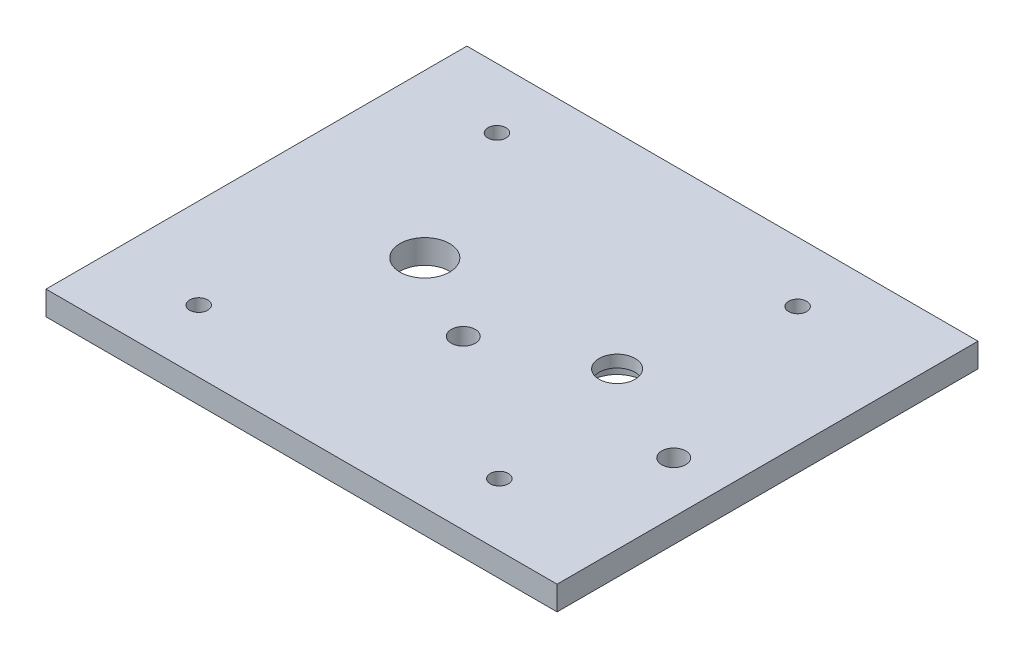
ISO-10303-21;
HEADER;
FILE_DESCRIPTION(('STEP AP214'),'2;1');
FILE_NAME('part.step','',(''),(''),'','','');
FILE_SCHEMA(('AUTOMOTIVE_DESIGN { 1 0 10303 214 1 1 1 1 }'));
ENDSEC;
DATA;
#1=APPLICATION_CONTEXT('core data for automotive mechanical design processes');
#2=APPLICATION_PROTOCOL_DEFINITION('international standard','automotive_design',2000,#1);
#3=PRODUCT_CONTEXT('',#1,'mechanical');
#4=PRODUCT('Part','Part','',(#3));
#5=PRODUCT_RELATED_PRODUCT_CATEGORY('part','',(#4));
#6=PRODUCT_DEFINITION_FORMATION('','',#4);
#7=PRODUCT_DEFINITION_CONTEXT('part definition',#1,'design');
#8=PRODUCT_DEFINITION('design','',#6,#7);
#9=PRODUCT_DEFINITION_SHAPE('','',#8);
#10=(LENGTH_UNIT() NAMED_UNIT(*) SI_UNIT(.MILLI.,.METRE.));
#11=(NAMED_UNIT(*) PLANE_ANGLE_UNIT() SI_UNIT($,.RADIAN.));
#12=(NAMED_UNIT(*) SI_UNIT($,.STERADIAN.) SOLID_ANGLE_UNIT());
#13=UNCERTAINTY_MEASURE_WITH_UNIT(LENGTH_MEASURE(1.E-05),#10,'distance_accuracy_value','');
#14=(GEOMETRIC_REPRESENTATION_CONTEXT(3) GLOBAL_UNCERTAINTY_ASSIGNED_CONTEXT((#13)) GLOBAL_UNIT_ASSIGNED_CONTEXT((#10,
#11,#12)) REPRESENTATION_CONTEXT('',''));
#15=CARTESIAN_POINT('',(0.,0.,0.));
#16=DIRECTION('',(0.,0.,1.));
#17=DIRECTION('',(1.,0.,0.));
#18=AXIS2_PLACEMENT_3D('',#15,#16,#17);
#19=CARTESIAN_POINT('',(42.5,4.,0.));
#20=DIRECTION('',(1.,0.,0.));
#21=DIRECTION('',(0.,0.,-1.));
#22=AXIS2_PLACEMENT_3D('',#19,#20,#21);
#23=PLANE('',#22);
#24=DIRECTION('',(0.,0.,1.));
#25=VECTOR('',#24,1.);
#26=CARTESIAN_POINT('',(42.5,0.,0.));
#27=LINE('',#26,#25);
#28=CARTESIAN_POINT('',(42.5,0.,-35.));
#29=VERTEX_POINT('',#28);
#30=CARTESIAN_POINT('',(42.5,0.,35.));
#31=VERTEX_POINT('',#30);
#32=EDGE_CURVE('E134',#29,#31,#27,.T.);
#33=ORIENTED_EDGE('',*,*,#32,.F.);
#34=DIRECTION('',(0.,-1.,0.));
#35=VECTOR('',#34,1.);
#36=CARTESIAN_POINT('',(42.5,4.,-35.));
#37=LINE('',#36,#35);
#38=CARTESIAN_POINT('',(42.5,4.,-35.));
#39=VERTEX_POINT('',#38);
#40=EDGE_CURVE('E11',#39,#29,#37,.T.);
#41=ORIENTED_EDGE('',*,*,#40,.F.);
#42=DIRECTION('',(0.,0.,1.));
#43=VECTOR('',#42,1.);
#44=CARTESIAN_POINT('',(42.5,4.,0.));
#45=LINE('',#44,#43);
#46=CARTESIAN_POINT('',(42.5,4.,35.));
#47=VERTEX_POINT('',#46);
#48=EDGE_CURVE('E103',#39,#47,#45,.T.);
#49=ORIENTED_EDGE('',*,*,#48,.T.);
#50=DIRECTION('',(0.,-1.,0.));
#51=VECTOR('',#50,1.);
#52=CARTESIAN_POINT('',(42.5,4.,35.));
#53=LINE('',#52,#51);
#54=EDGE_CURVE('E80',#47,#31,#53,.T.);
#55=ORIENTED_EDGE('',*,*,#54,.T.);
#56=EDGE_LOOP('',(#33,#41,#49,#55));
#57=FACE_BOUND('',#56,.T.);
#58=ADVANCED_FACE('F39',(#57),#23,.T.);
#59=CARTESIAN_POINT('',(0.,4.,-35.));
#60=DIRECTION('',(0.,0.,-1.));
#61=DIRECTION('',(-1.,0.,0.));
#62=AXIS2_PLACEMENT_3D('',#59,#60,#61);
#63=PLANE('',#62);
#64=DIRECTION('',(1.,0.,0.));
#65=VECTOR('',#64,1.);
#66=CARTESIAN_POINT('',(0.,0.,-35.));
#67=LINE('',#66,#65);
#68=CARTESIAN_POINT('',(-42.5,0.,-35.));
#69=VERTEX_POINT('',#68);
#70=EDGE_CURVE('E92',#69,#29,#67,.T.);
#71=ORIENTED_EDGE('',*,*,#70,.F.);
#72=DIRECTION('',(0.,-1.,0.));
#73=VECTOR('',#72,1.);
#74=CARTESIAN_POINT('',(-42.5,4.,-35.));
#75=LINE('',#74,#73);
#76=CARTESIAN_POINT('',(-42.5,4.,-35.));
#77=VERTEX_POINT('',#76);
#78=EDGE_CURVE('E49',#77,#69,#75,.T.);
#79=ORIENTED_EDGE('',*,*,#78,.F.);
#80=DIRECTION('',(1.,0.,0.));
#81=VECTOR('',#80,1.);
#82=CARTESIAN_POINT('',(0.,4.,-35.));
#83=LINE('',#82,#81);
#84=EDGE_CURVE('E90',#77,#39,#83,.T.);
#85=ORIENTED_EDGE('',*,*,#84,.T.);
#86=ORIENTED_EDGE('',*,*,#40,.T.);
#87=EDGE_LOOP('',(#71,#79,#85,#86));
#88=FACE_BOUND('',#87,.T.);
#89=ADVANCED_FACE('F88',(#88),#63,.T.);
#90=CARTESIAN_POINT('',(-42.5,4.,0.));
#91=DIRECTION('',(1.,0.,0.));
#92=DIRECTION('',(0.,0.,-1.));
#93=AXIS2_PLACEMENT_3D('',#90,#91,#92);
#94=PLANE('',#93);
#95=DIRECTION('',(0.,0.,1.));
#96=VECTOR('',#95,1.);
#97=CARTESIAN_POINT('',(-42.5,0.,0.));
#98=LINE('',#97,#96);
#99=CARTESIAN_POINT('',(-42.5,0.,35.));
#100=VERTEX_POINT('',#99);
#101=EDGE_CURVE('E137',#69,#100,#98,.T.);
#102=ORIENTED_EDGE('',*,*,#101,.T.);
#103=DIRECTION('',(0.,-1.,0.));
#104=VECTOR('',#103,1.);
#105=CARTESIAN_POINT('',(-42.5,4.,35.));
#106=LINE('',#105,#104);
#107=CARTESIAN_POINT('',(-42.5,4.,35.));
#108=VERTEX_POINT('',#107);
#109=EDGE_CURVE('E95',#108,#100,#106,.T.);
#110=ORIENTED_EDGE('',*,*,#109,.F.);
#111=DIRECTION('',(0.,0.,1.));
#112=VECTOR('',#111,1.);
#113=CARTESIAN_POINT('',(-42.5,4.,0.));
#114=LINE('',#113,#112);
#115=EDGE_CURVE('E98',#77,#108,#114,.T.);
#116=ORIENTED_EDGE('',*,*,#115,.F.);
#117=ORIENTED_EDGE('',*,*,#78,.T.);
#118=EDGE_LOOP('',(#102,#110,#116,#117));
#119=FACE_BOUND('',#118,.T.);
#120=ADVANCED_FACE('F99',(#119),#94,.F.);
#121=CARTESIAN_POINT('',(-0.999999999999987,4.,7.10266073478272));
#122=DIRECTION('',(0.,-1.,0.));
#123=DIRECTION('',(0.,0.,-1.));
#124=AXIS2_PLACEMENT_3D('',#121,#122,#123);
#125=CYLINDRICAL_SURFACE('',#124,2.);
#126=CARTESIAN_POINT('',(-0.999999999999987,4.,7.10266073478272));
#127=DIRECTION('',(0.,1.,0.));
#128=DIRECTION('',(0.,0.,1.));
#129=AXIS2_PLACEMENT_3D('',#126,#127,#128);
#130=CIRCLE('',#129,2.);
#131=CARTESIAN_POINT('',(-0.999999999999987,4.,9.10266073478272));
#132=VERTEX_POINT('',#131);
#133=EDGE_CURVE('E116',#132,#132,#130,.T.);
#134=ORIENTED_EDGE('',*,*,#133,.T.);
#135=EDGE_LOOP('',(#134));
#136=FACE_BOUND('',#135,.T.);
#137=CARTESIAN_POINT('',(-0.999999999999987,0.,7.10266073478272));
#138=DIRECTION('',(0.,1.,0.));
#139=DIRECTION('',(0.,0.,1.));
#140=AXIS2_PLACEMENT_3D('',#137,#138,#139);
#141=CIRCLE('',#140,2.);
#142=CARTESIAN_POINT('',(-0.999999999999987,0.,9.10266073478272));
#143=VERTEX_POINT('',#142);
#144=EDGE_CURVE('E146',#143,#143,#141,.T.);
#145=ORIENTED_EDGE('',*,*,#144,.F.);
#146=EDGE_LOOP('',(#145));
#147=FACE_BOUND('',#146,.T.);
#148=ADVANCED_FACE('F209',(#136,#147),#125,.F.);
#149=CARTESIAN_POINT('',(-15.5,4.,-0.999999999999982));
#150=DIRECTION('',(0.,-1.,0.));
#151=DIRECTION('',(0.,0.,-1.));
#152=AXIS2_PLACEMENT_3D('',#149,#150,#151);
#153=CYLINDRICAL_SURFACE('',#152,4.125);
#154=CARTESIAN_POINT('',(-15.5,4.,-0.999999999999982));
#155=DIRECTION('',(0.,1.,0.));
#156=DIRECTION('',(0.,0.,1.));
#157=AXIS2_PLACEMENT_3D('',#154,#155,#156);
#158=CIRCLE('',#157,4.125);
#159=CARTESIAN_POINT('',(-15.5,4.,3.12500000000002));
#160=VERTEX_POINT('',#159);
#161=EDGE_CURVE('E113',#160,#160,#158,.T.);
#162=ORIENTED_EDGE('',*,*,#161,.T.);
#163=EDGE_LOOP('',(#162));
#164=FACE_BOUND('',#163,.T.);
#165=CARTESIAN_POINT('',(-15.5,0.,-0.999999999999982));
#166=DIRECTION('',(0.,1.,0.));
#167=DIRECTION('',(0.,0.,1.));
#168=AXIS2_PLACEMENT_3D('',#165,#166,#167);
#169=CIRCLE('',#168,4.125);
#170=CARTESIAN_POINT('',(-15.5,0.,3.12500000000002));
#171=VERTEX_POINT('',#170);
#172=EDGE_CURVE('E143',#171,#171,#169,.T.);
#173=ORIENTED_EDGE('',*,*,#172,.F.);
#174=EDGE_LOOP('',(#173));
#175=FACE_BOUND('',#174,.T.);
#176=ADVANCED_FACE('F212',(#164,#175),#153,.F.);
#177=CARTESIAN_POINT('',(-27.5,4.,24.6066772895717));
#178=DIRECTION('',(0.,-1.,0.));
#179=DIRECTION('',(0.,0.,-1.));
#180=AXIS2_PLACEMENT_3D('',#177,#178,#179);
#181=CYLINDRICAL_SURFACE('',#180,1.5);
#182=CARTESIAN_POINT('',(-27.5,4.,24.6066772895717));
#183=DIRECTION('',(0.,1.,0.));
#184=DIRECTION('',(0.,0.,1.));
#185=AXIS2_PLACEMENT_3D('',#182,#183,#184);
#186=CIRCLE('',#185,1.5);
#187=CARTESIAN_POINT('',(-27.5,4.,26.1066772895717));
#188=VERTEX_POINT('',#187);
#189=EDGE_CURVE('E110',#188,#188,#186,.F.);
#190=ORIENTED_EDGE('',*,*,#189,.F.);
#191=EDGE_LOOP('',(#190));
#192=FACE_BOUND('',#191,.T.);
#193=CARTESIAN_POINT('',(-27.5,0.,24.6066772895717));
#194=DIRECTION('',(0.,1.,0.));
#195=DIRECTION('',(0.,0.,1.));
#196=AXIS2_PLACEMENT_3D('',#193,#194,#195);
#197=CIRCLE('',#196,1.5);
#198=CARTESIAN_POINT('',(-27.5,0.,26.1066772895717));
#199=VERTEX_POINT('',#198);
#200=EDGE_CURVE('E140',#199,#199,#197,.F.);
#201=ORIENTED_EDGE('',*,*,#200,.T.);
#202=EDGE_LOOP('',(#201));
#203=FACE_BOUND('',#202,.T.);
#204=ADVANCED_FACE('F216',(#192,#203),#181,.F.);
#205=CARTESIAN_POINT('',(0.,4.,35.));
#206=DIRECTION('',(0.,0.,-1.));
#207=DIRECTION('',(-1.,0.,0.));
#208=AXIS2_PLACEMENT_3D('',#205,#206,#207);
#209=PLANE('',#208);
#210=DIRECTION('',(1.,0.,0.));
#211=VECTOR('',#210,1.);
#212=CARTESIAN_POINT('',(0.,0.,35.));
#213=LINE('',#212,#211);
#214=EDGE_CURVE('E73',#100,#31,#213,.T.);
#215=ORIENTED_EDGE('',*,*,#214,.T.);
#216=ORIENTED_EDGE('',*,*,#54,.F.);
#217=DIRECTION('',(1.,0.,0.));
#218=VECTOR('',#217,1.);
#219=CARTESIAN_POINT('',(0.,4.,35.));
#220=LINE('',#219,#218);
#221=EDGE_CURVE('E57',#108,#47,#220,.T.);
#222=ORIENTED_EDGE('',*,*,#221,.F.);
#223=ORIENTED_EDGE('',*,*,#109,.T.);
#224=EDGE_LOOP('',(#215,#216,#222,#223));
#225=FACE_BOUND('',#224,.T.);
#226=ADVANCED_FACE('F152',(#225),#209,.F.);
#227=CARTESIAN_POINT('',(-27.5,4.,-25.));
#228=DIRECTION('',(0.,-1.,0.));
#229=DIRECTION('',(0.,0.,-1.));
#230=AXIS2_PLACEMENT_3D('',#227,#228,#229);
#231=CYLINDRICAL_SURFACE('',#230,1.5);
#232=CARTESIAN_POINT('',(-27.5,4.,-25.));
#233=DIRECTION('',(0.,1.,0.));
#234=DIRECTION('',(0.,0.,1.));
#235=AXIS2_PLACEMENT_3D('',#232,#233,#234);
#236=CIRCLE('',#235,1.5);
#237=CARTESIAN_POINT('',(-27.5,4.,-23.5));
#238=VERTEX_POINT('',#237);
#239=EDGE_CURVE('E105',#238,#238,#236,.T.);
#240=ORIENTED_EDGE('',*,*,#239,.T.);
#241=EDGE_LOOP('',(#240));
#242=FACE_BOUND('',#241,.T.);
#243=CARTESIAN_POINT('',(-27.5,0.,-25.));
#244=DIRECTION('',(0.,1.,0.));
#245=DIRECTION('',(0.,0.,1.));
#246=AXIS2_PLACEMENT_3D('',#243,#244,#245);
#247=CIRCLE('',#246,1.5);
#248=CARTESIAN_POINT('',(-27.5,0.,-23.5));
#249=VERTEX_POINT('',#248);
#250=EDGE_CURVE('E131',#249,#249,#247,.T.);
#251=ORIENTED_EDGE('',*,*,#250,.F.);
#252=EDGE_LOOP('',(#251));
#253=FACE_BOUND('',#252,.T.);
#254=ADVANCED_FACE('F163',(#242,#253),#231,.F.);
#255=CARTESIAN_POINT('',(22.5,4.,-25.));
#256=DIRECTION('',(0.,-1.,0.));
#257=DIRECTION('',(0.,0.,-1.));
#258=AXIS2_PLACEMENT_3D('',#255,#256,#257);
#259=CYLINDRICAL_SURFACE('',#258,1.5);
#260=CARTESIAN_POINT('',(22.5,4.,-25.));
#261=DIRECTION('',(0.,1.,0.));
#262=DIRECTION('',(0.,0.,1.));
#263=AXIS2_PLACEMENT_3D('',#260,#261,#262);
#264=CIRCLE('',#263,1.5);
#265=CARTESIAN_POINT('',(22.5,4.,-23.5));
#266=VERTEX_POINT('',#265);
#267=EDGE_CURVE('E313',#266,#266,#264,.T.);
#268=ORIENTED_EDGE('',*,*,#267,.T.);
#269=EDGE_LOOP('',(#268));
#270=FACE_BOUND('',#269,.T.);
#271=CARTESIAN_POINT('',(22.5,0.,-25.));
#272=DIRECTION('',(0.,1.,0.));
#273=DIRECTION('',(0.,0.,1.));
#274=AXIS2_PLACEMENT_3D('',#271,#272,#273);
#275=CIRCLE('',#274,1.5);
#276=CARTESIAN_POINT('',(22.5,0.,-23.5));
#277=VERTEX_POINT('',#276);
#278=EDGE_CURVE('E128',#277,#277,#275,.T.);
#279=ORIENTED_EDGE('',*,*,#278,.F.);
#280=EDGE_LOOP('',(#279));
#281=FACE_BOUND('',#280,.T.);
#282=ADVANCED_FACE('F166',(#270,#281),#259,.F.);
#283=CARTESIAN_POINT('',(22.5,4.,24.6066772895717));
#284=DIRECTION('',(0.,-1.,0.));
#285=DIRECTION('',(0.,0.,-1.));
#286=AXIS2_PLACEMENT_3D('',#283,#284,#285);
#287=CYLINDRICAL_SURFACE('',#286,1.5);
#288=CARTESIAN_POINT('',(22.5,4.,24.6066772895717));
#289=DIRECTION('',(0.,1.,0.));
#290=DIRECTION('',(0.,0.,1.));
#291=AXIS2_PLACEMENT_3D('',#288,#289,#290);
#292=CIRCLE('',#291,1.5);
#293=CARTESIAN_POINT('',(22.5,4.,26.1066772895717));
#294=VERTEX_POINT('',#293);
#295=EDGE_CURVE('E181',#294,#294,#292,.F.);
#296=ORIENTED_EDGE('',*,*,#295,.F.);
#297=EDGE_LOOP('',(#296));
#298=FACE_BOUND('',#297,.T.);
#299=CARTESIAN_POINT('',(22.5,0.,24.6066772895717));
#300=DIRECTION('',(0.,1.,0.));
#301=DIRECTION('',(0.,0.,1.));
#302=AXIS2_PLACEMENT_3D('',#299,#300,#301);
#303=CIRCLE('',#302,1.5);
#304=CARTESIAN_POINT('',(22.5,0.,26.1066772895717));
#305=VERTEX_POINT('',#304);
#306=EDGE_CURVE('E125',#305,#305,#303,.F.);
#307=ORIENTED_EDGE('',*,*,#306,.T.);
#308=EDGE_LOOP('',(#307));
#309=FACE_BOUND('',#308,.T.);
#310=ADVANCED_FACE('F169',(#298,#309),#287,.F.);
#311=CARTESIAN_POINT('',(34.,4.,7.10266073478268));
#312=DIRECTION('',(0.,-1.,0.));
#313=DIRECTION('',(0.,0.,-1.));
#314=AXIS2_PLACEMENT_3D('',#311,#312,#313);
#315=CYLINDRICAL_SURFACE('',#314,2.);
#316=CARTESIAN_POINT('',(34.,4.,7.10266073478268));
#317=DIRECTION('',(0.,1.,0.));
#318=DIRECTION('',(0.,0.,1.));
#319=AXIS2_PLACEMENT_3D('',#316,#317,#318);
#320=CIRCLE('',#319,2.);
#321=CARTESIAN_POINT('',(34.,4.,9.10266073478269));
#322=VERTEX_POINT('',#321);
#323=EDGE_CURVE('E149',#322,#322,#320,.T.);
#324=ORIENTED_EDGE('',*,*,#323,.T.);
#325=EDGE_LOOP('',(#324));
#326=FACE_BOUND('',#325,.T.);
#327=CARTESIAN_POINT('',(34.,0.,7.10266073478268));
#328=DIRECTION('',(0.,1.,0.));
#329=DIRECTION('',(0.,0.,1.));
#330=AXIS2_PLACEMENT_3D('',#327,#328,#329);
#331=CIRCLE('',#330,2.);
#332=CARTESIAN_POINT('',(34.,0.,9.10266073478269));
#333=VERTEX_POINT('',#332);
#334=EDGE_CURVE('E122',#333,#333,#331,.T.);
#335=ORIENTED_EDGE('',*,*,#334,.F.);
#336=EDGE_LOOP('',(#335));
#337=FACE_BOUND('',#336,.T.);
#338=ADVANCED_FACE('F41',(#326,#337),#315,.F.);
#339=CARTESIAN_POINT('',(16.4783394877401,4.,-0.999882702112446));
#340=DIRECTION('',(0.,-1.,0.));
#341=DIRECTION('',(0.,0.,-1.));
#342=AXIS2_PLACEMENT_3D('',#339,#340,#341);
#343=CYLINDRICAL_SURFACE('',#342,2.99999999999999);
#344=CARTESIAN_POINT('',(16.4783394877401,2.,-0.999882702112446));
#345=DIRECTION('',(0.,1.,0.));
#346=DIRECTION('',(0.,0.,1.));
#347=AXIS2_PLACEMENT_3D('',#344,#345,#346);
#348=CIRCLE('',#347,2.99999999999999);
#349=CARTESIAN_POINT('',(16.4783394877401,2.,2.00011729788755));
#350=VERTEX_POINT('',#349);
#351=EDGE_CURVE('E43',#350,#350,#348,.T.);
#352=ORIENTED_EDGE('',*,*,#351,.F.);
#353=EDGE_LOOP('',(#352));
#354=FACE_BOUND('',#353,.T.);
#355=CARTESIAN_POINT('',(16.4783394877401,4.,-0.999882702112446));
#356=DIRECTION('',(0.,1.,0.));
#357=DIRECTION('',(0.,0.,1.));
#358=AXIS2_PLACEMENT_3D('',#355,#356,#357);
#359=CIRCLE('',#358,2.99999999999999);
#360=CARTESIAN_POINT('',(16.4783394877401,4.,2.00011729788755));
#361=VERTEX_POINT('',#360);
#362=EDGE_CURVE('E119',#361,#361,#359,.T.);
#363=ORIENTED_EDGE('',*,*,#362,.T.);
#364=EDGE_LOOP('',(#363));
#365=FACE_BOUND('',#364,.T.);
#366=ADVANCED_FACE('F176',(#354,#365),#343,.F.);
#367=CARTESIAN_POINT('',(0.,4.,0.));
#368=DIRECTION('',(0.,1.,0.));
#369=DIRECTION('',(0.,0.,1.));
#370=AXIS2_PLACEMENT_3D('',#367,#368,#369);
#371=PLANE('',#370);
#372=ORIENTED_EDGE('',*,*,#323,.F.);
#373=EDGE_LOOP('',(#372));
#374=FACE_BOUND('',#373,.T.);
#375=ORIENTED_EDGE('',*,*,#295,.T.);
#376=EDGE_LOOP('',(#375));
#377=FACE_BOUND('',#376,.T.);
#378=ORIENTED_EDGE('',*,*,#267,.F.);
#379=EDGE_LOOP('',(#378));
#380=FACE_BOUND('',#379,.T.);
#381=ORIENTED_EDGE('',*,*,#239,.F.);
#382=EDGE_LOOP('',(#381));
#383=FACE_BOUND('',#382,.T.);
#384=ORIENTED_EDGE('',*,*,#48,.F.);
#385=ORIENTED_EDGE('',*,*,#84,.F.);
#386=ORIENTED_EDGE('',*,*,#115,.T.);
#387=ORIENTED_EDGE('',*,*,#221,.T.);
#388=EDGE_LOOP('',(#384,#385,#386,#387));
#389=FACE_BOUND('',#388,.T.);
#390=ORIENTED_EDGE('',*,*,#189,.T.);
#391=EDGE_LOOP('',(#390));
#392=FACE_BOUND('',#391,.T.);
#393=ORIENTED_EDGE('',*,*,#161,.F.);
#394=EDGE_LOOP('',(#393));
#395=FACE_BOUND('',#394,.T.);
#396=ORIENTED_EDGE('',*,*,#133,.F.);
#397=EDGE_LOOP('',(#396));
#398=FACE_BOUND('',#397,.T.);
#399=ORIENTED_EDGE('',*,*,#362,.F.);
#400=EDGE_LOOP('',(#399));
#401=FACE_BOUND('',#400,.T.);
#402=ADVANCED_FACE('F101',(#374,#377,#380,#383,#389,#392,#395,#398,#401),#371,.T.);
#403=CARTESIAN_POINT('',(0.,0.,0.));
#404=DIRECTION('',(0.,1.,0.));
#405=DIRECTION('',(0.,0.,1.));
#406=AXIS2_PLACEMENT_3D('',#403,#404,#405);
#407=PLANE('',#406);
#408=CARTESIAN_POINT('',(16.4783394877401,0.,-0.999882702112446));
#409=DIRECTION('',(0.,1.,0.));
#410=DIRECTION('',(0.,0.,1.));
#411=AXIS2_PLACEMENT_3D('',#408,#409,#410);
#412=CIRCLE('',#411,4.5);
#413=CARTESIAN_POINT('',(16.4783394877401,0.,3.50011729788756));
#414=VERTEX_POINT('',#413);
#415=EDGE_CURVE('E306',#414,#414,#412,.T.);
#416=ORIENTED_EDGE('',*,*,#415,.T.);
#417=EDGE_LOOP('',(#416));
#418=FACE_BOUND('',#417,.T.);
#419=ORIENTED_EDGE('',*,*,#334,.T.);
#420=EDGE_LOOP('',(#419));
#421=FACE_BOUND('',#420,.T.);
#422=ORIENTED_EDGE('',*,*,#306,.F.);
#423=EDGE_LOOP('',(#422));
#424=FACE_BOUND('',#423,.T.);
#425=ORIENTED_EDGE('',*,*,#278,.T.);
#426=EDGE_LOOP('',(#425));
#427=FACE_BOUND('',#426,.T.);
#428=ORIENTED_EDGE('',*,*,#250,.T.);
#429=EDGE_LOOP('',(#428));
#430=FACE_BOUND('',#429,.T.);
#431=ORIENTED_EDGE('',*,*,#32,.T.);
#432=ORIENTED_EDGE('',*,*,#214,.F.);
#433=ORIENTED_EDGE('',*,*,#101,.F.);
#434=ORIENTED_EDGE('',*,*,#70,.T.);
#435=EDGE_LOOP('',(#431,#432,#433,#434));
#436=FACE_BOUND('',#435,.T.);
#437=ORIENTED_EDGE('',*,*,#200,.F.);
#438=EDGE_LOOP('',(#437));
#439=FACE_BOUND('',#438,.T.);
#440=ORIENTED_EDGE('',*,*,#172,.T.);
#441=EDGE_LOOP('',(#440));
#442=FACE_BOUND('',#441,.T.);
#443=ORIENTED_EDGE('',*,*,#144,.T.);
#444=EDGE_LOOP('',(#443));
#445=FACE_BOUND('',#444,.T.);
#446=ADVANCED_FACE('F153',(#418,#421,#424,#427,#430,#436,#439,#442,#445),#407,.F.);
#447=CARTESIAN_POINT('',(16.4783394877401,2.,-0.999882702112446));
#448=DIRECTION('',(0.,-1.,0.));
#449=DIRECTION('',(0.,0.,-1.));
#450=AXIS2_PLACEMENT_3D('',#447,#448,#449);
#451=CYLINDRICAL_SURFACE('',#450,4.5);
#452=CARTESIAN_POINT('',(16.4783394877401,2.,-0.999882702112446));
#453=DIRECTION('',(0.,1.,0.));
#454=DIRECTION('',(0.,0.,1.));
#455=AXIS2_PLACEMENT_3D('',#452,#453,#454);
#456=CIRCLE('',#455,4.5);
#457=CARTESIAN_POINT('',(16.4783394877401,2.,3.50011729788756));
#458=VERTEX_POINT('',#457);
#459=EDGE_CURVE('E305',#458,#458,#456,.T.);
#460=ORIENTED_EDGE('',*,*,#459,.T.);
#461=EDGE_LOOP('',(#460));
#462=FACE_BOUND('',#461,.T.);
#463=ORIENTED_EDGE('',*,*,#415,.F.);
#464=EDGE_LOOP('',(#463));
#465=FACE_BOUND('',#464,.T.);
#466=ADVANCED_FACE('F186',(#462,#465),#451,.F.);
#467=CARTESIAN_POINT('',(16.4783394877401,2.,-0.999882702112446));
#468=DIRECTION('',(0.,1.,0.));
#469=DIRECTION('',(0.,0.,1.));
#470=AXIS2_PLACEMENT_3D('',#467,#468,#469);
#471=PLANE('',#470);
#472=ORIENTED_EDGE('',*,*,#351,.T.);
#473=EDGE_LOOP('',(#472));
#474=FACE_BOUND('',#473,.T.);
#475=ORIENTED_EDGE('',*,*,#459,.F.);
#476=EDGE_LOOP('',(#475));
#477=FACE_BOUND('',#476,.T.);
#478=ADVANCED_FACE('F198',(#474,#477),#471,.F.);
#479=CLOSED_SHELL('',(#58,#89,#120,#148,#176,#204,#226,#254,#282,#310,#338,#366,#402,#446,#466,#478));
#480=MANIFOLD_SOLID_BREP('B2',#479);
#481=ADVANCED_BREP_SHAPE_REPRESENTATION('',(#18,#480),#14);
#482=SHAPE_DEFINITION_REPRESENTATION(#9,#481);
ENDSEC;
END-ISO-10303-21;
